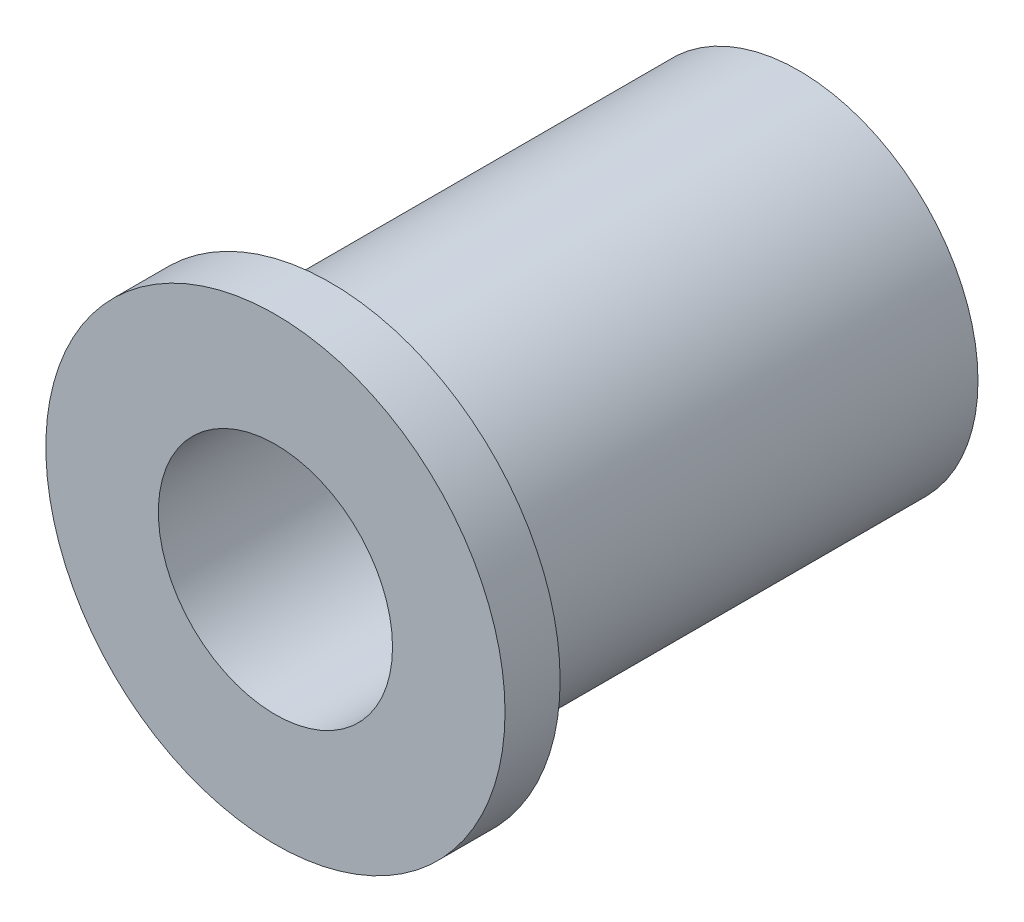
ISO-10303-21;
HEADER;
FILE_DESCRIPTION(('STEP AP214'),'2;1');
FILE_NAME('part.step','',(''),(''),'','','');
FILE_SCHEMA(('AUTOMOTIVE_DESIGN { 1 0 10303 214 1 1 1 1 }'));
ENDSEC;
DATA;
#1=APPLICATION_CONTEXT('core data for automotive mechanical design processes');
#2=APPLICATION_PROTOCOL_DEFINITION('international standard','automotive_design',2000,#1);
#3=PRODUCT_CONTEXT('',#1,'mechanical');
#4=PRODUCT('Part','Part','',(#3));
#5=PRODUCT_RELATED_PRODUCT_CATEGORY('part','',(#4));
#6=PRODUCT_DEFINITION_FORMATION('','',#4);
#7=PRODUCT_DEFINITION_CONTEXT('part definition',#1,'design');
#8=PRODUCT_DEFINITION('design','',#6,#7);
#9=PRODUCT_DEFINITION_SHAPE('','',#8);
#10=(LENGTH_UNIT() NAMED_UNIT(*) SI_UNIT(.MILLI.,.METRE.));
#11=(NAMED_UNIT(*) PLANE_ANGLE_UNIT() SI_UNIT($,.RADIAN.));
#12=(NAMED_UNIT(*) SI_UNIT($,.STERADIAN.) SOLID_ANGLE_UNIT());
#13=UNCERTAINTY_MEASURE_WITH_UNIT(LENGTH_MEASURE(1.E-05),#10,'distance_accuracy_value','');
#14=(GEOMETRIC_REPRESENTATION_CONTEXT(3) GLOBAL_UNCERTAINTY_ASSIGNED_CONTEXT((#13)) GLOBAL_UNIT_ASSIGNED_CONTEXT((#10,
#11,#12)) REPRESENTATION_CONTEXT('',''));
#15=CARTESIAN_POINT('',(0.,0.,0.));
#16=DIRECTION('',(0.,0.,1.));
#17=DIRECTION('',(1.,0.,0.));
#18=AXIS2_PLACEMENT_3D('',#15,#16,#17);
#19=CARTESIAN_POINT('',(0.,0.,14.478));
#20=DIRECTION('',(0.,0.,-1.));
#21=DIRECTION('',(-1.,0.,0.));
#22=AXIS2_PLACEMENT_3D('',#19,#20,#21);
#23=CYLINDRICAL_SURFACE('',#22,4.953);
#24=CARTESIAN_POINT('',(0.,0.,0.));
#25=DIRECTION('',(0.,0.,1.));
#26=DIRECTION('',(1.,0.,0.));
#27=AXIS2_PLACEMENT_3D('',#24,#25,#26);
#28=CIRCLE('',#27,4.953);
#29=CARTESIAN_POINT('',(4.953,0.,0.));
#30=VERTEX_POINT('',#29);
#31=EDGE_CURVE('E40',#30,#30,#28,.T.);
#32=ORIENTED_EDGE('',*,*,#31,.T.);
#33=EDGE_LOOP('',(#32));
#34=FACE_BOUND('',#33,.T.);
#35=CARTESIAN_POINT('',(0.,0.,12.954));
#36=DIRECTION('',(0.,0.,1.));
#37=DIRECTION('',(1.,0.,0.));
#38=AXIS2_PLACEMENT_3D('',#35,#36,#37);
#39=CIRCLE('',#38,4.953);
#40=CARTESIAN_POINT('',(4.953,0.,12.954));
#41=VERTEX_POINT('',#40);
#42=EDGE_CURVE('E10',#41,#41,#39,.T.);
#43=ORIENTED_EDGE('',*,*,#42,.F.);
#44=EDGE_LOOP('',(#43));
#45=FACE_BOUND('',#44,.T.);
#46=ADVANCED_FACE('F37',(#34,#45),#23,.T.);
#47=CARTESIAN_POINT('',(0.,0.,14.478));
#48=DIRECTION('',(0.,0.,1.));
#49=DIRECTION('',(1.,0.,0.));
#50=AXIS2_PLACEMENT_3D('',#47,#48,#49);
#51=PLANE('',#50);
#52=CARTESIAN_POINT('',(0.,0.,14.478));
#53=DIRECTION('',(0.,0.,1.));
#54=DIRECTION('',(1.,0.,0.));
#55=AXIS2_PLACEMENT_3D('',#52,#53,#54);
#56=CIRCLE('',#55,3.2385);
#57=CARTESIAN_POINT('',(3.2385,0.,14.478));
#58=VERTEX_POINT('',#57);
#59=EDGE_CURVE('E48',#58,#58,#56,.T.);
#60=ORIENTED_EDGE('',*,*,#59,.F.);
#61=EDGE_LOOP('',(#60));
#62=FACE_BOUND('',#61,.T.);
#63=CARTESIAN_POINT('',(0.,0.,14.478));
#64=DIRECTION('',(0.,0.,1.));
#65=DIRECTION('',(1.,0.,0.));
#66=AXIS2_PLACEMENT_3D('',#63,#64,#65);
#67=CIRCLE('',#66,6.35);
#68=CARTESIAN_POINT('',(6.35,0.,14.478));
#69=VERTEX_POINT('',#68);
#70=EDGE_CURVE('E51',#69,#69,#67,.T.);
#71=ORIENTED_EDGE('',*,*,#70,.T.);
#72=EDGE_LOOP('',(#71));
#73=FACE_BOUND('',#72,.T.);
#74=ADVANCED_FACE('F65',(#62,#73),#51,.T.);
#75=CARTESIAN_POINT('',(0.,0.,0.));
#76=DIRECTION('',(0.,0.,1.));
#77=DIRECTION('',(1.,0.,0.));
#78=AXIS2_PLACEMENT_3D('',#75,#76,#77);
#79=PLANE('',#78);
#80=ORIENTED_EDGE('',*,*,#31,.F.);
#81=EDGE_LOOP('',(#80));
#82=FACE_BOUND('',#81,.T.);
#83=CARTESIAN_POINT('',(0.,0.,0.));
#84=DIRECTION('',(0.,0.,1.));
#85=DIRECTION('',(1.,0.,0.));
#86=AXIS2_PLACEMENT_3D('',#83,#84,#85);
#87=CIRCLE('',#86,3.2385);
#88=CARTESIAN_POINT('',(3.2385,0.,0.));
#89=VERTEX_POINT('',#88);
#90=EDGE_CURVE('E54',#89,#89,#87,.T.);
#91=ORIENTED_EDGE('',*,*,#90,.T.);
#92=EDGE_LOOP('',(#91));
#93=FACE_BOUND('',#92,.T.);
#94=ADVANCED_FACE('F84',(#82,#93),#79,.F.);
#95=CARTESIAN_POINT('',(0.,0.,14.478));
#96=DIRECTION('',(0.,0.,-1.));
#97=DIRECTION('',(-1.,0.,0.));
#98=AXIS2_PLACEMENT_3D('',#95,#96,#97);
#99=CYLINDRICAL_SURFACE('',#98,3.2385);
#100=ORIENTED_EDGE('',*,*,#59,.T.);
#101=EDGE_LOOP('',(#100));
#102=FACE_BOUND('',#101,.T.);
#103=ORIENTED_EDGE('',*,*,#90,.F.);
#104=EDGE_LOOP('',(#103));
#105=FACE_BOUND('',#104,.T.);
#106=ADVANCED_FACE('F74',(#102,#105),#99,.F.);
#107=CARTESIAN_POINT('',(0.,0.,12.954));
#108=DIRECTION('',(0.,0.,1.));
#109=DIRECTION('',(1.,0.,0.));
#110=AXIS2_PLACEMENT_3D('',#107,#108,#109);
#111=PLANE('',#110);
#112=CARTESIAN_POINT('',(0.,0.,12.954));
#113=DIRECTION('',(0.,0.,1.));
#114=DIRECTION('',(1.,0.,0.));
#115=AXIS2_PLACEMENT_3D('',#112,#113,#114);
#116=CIRCLE('',#115,6.35);
#117=CARTESIAN_POINT('',(6.35,0.,12.954));
#118=VERTEX_POINT('',#117);
#119=EDGE_CURVE('E56',#118,#118,#116,.T.);
#120=ORIENTED_EDGE('',*,*,#119,.F.);
#121=EDGE_LOOP('',(#120));
#122=FACE_BOUND('',#121,.T.);
#123=ORIENTED_EDGE('',*,*,#42,.T.);
#124=EDGE_LOOP('',(#123));
#125=FACE_BOUND('',#124,.T.);
#126=ADVANCED_FACE('F69',(#122,#125),#111,.F.);
#127=CARTESIAN_POINT('',(0.,0.,12.954));
#128=DIRECTION('',(0.,0.,1.));
#129=DIRECTION('',(1.,0.,0.));
#130=AXIS2_PLACEMENT_3D('',#127,#128,#129);
#131=CYLINDRICAL_SURFACE('',#130,6.35);
#132=ORIENTED_EDGE('',*,*,#119,.T.);
#133=EDGE_LOOP('',(#132));
#134=FACE_BOUND('',#133,.T.);
#135=ORIENTED_EDGE('',*,*,#70,.F.);
#136=EDGE_LOOP('',(#135));
#137=FACE_BOUND('',#136,.T.);
#138=ADVANCED_FACE('F67',(#134,#137),#131,.T.);
#139=CLOSED_SHELL('',(#46,#74,#94,#106,#126,#138));
#140=MANIFOLD_SOLID_BREP('B2',#139);
#141=ADVANCED_BREP_SHAPE_REPRESENTATION('',(#18,#140),#14);
#142=SHAPE_DEFINITION_REPRESENTATION(#9,#141);
ENDSEC;
END-ISO-10303-21;
